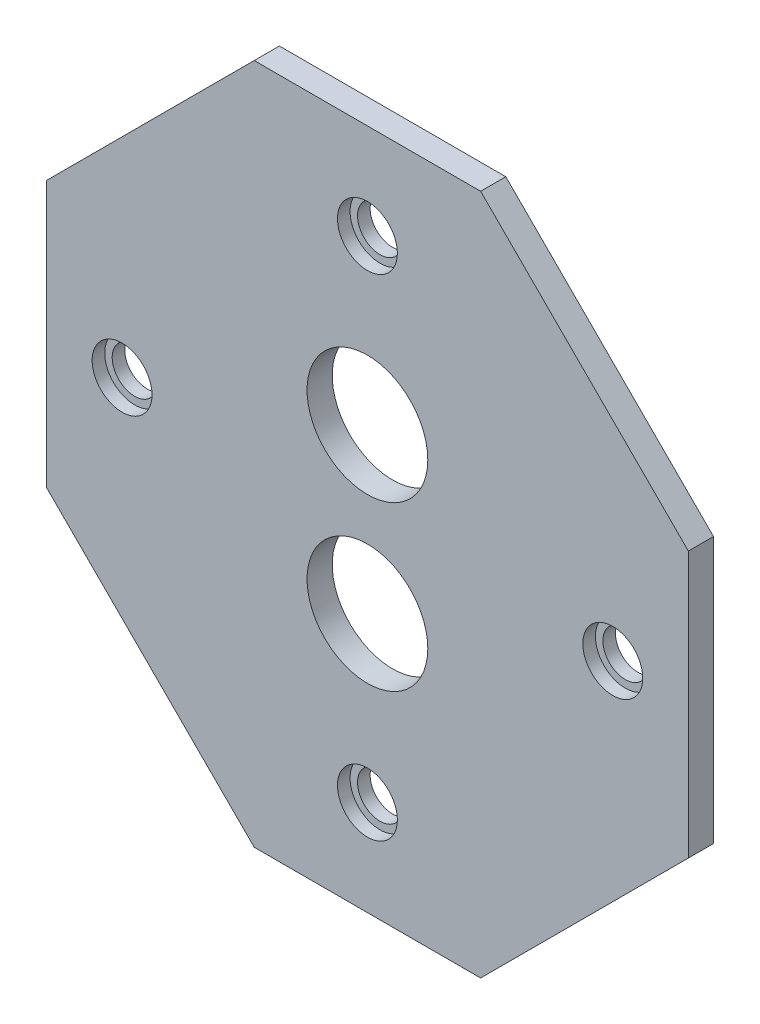
ISO-10303-21;
HEADER;
FILE_DESCRIPTION(('STEP AP214'),'2;1');
FILE_NAME('part.step','',(''),(''),'','','');
FILE_SCHEMA(('AUTOMOTIVE_DESIGN { 1 0 10303 214 1 1 1 1 }'));
ENDSEC;
DATA;
#1=APPLICATION_CONTEXT('core data for automotive mechanical design processes');
#2=APPLICATION_PROTOCOL_DEFINITION('international standard','automotive_design',2000,#1);
#3=PRODUCT_CONTEXT('',#1,'mechanical');
#4=PRODUCT('Part','Part','',(#3));
#5=PRODUCT_RELATED_PRODUCT_CATEGORY('part','',(#4));
#6=PRODUCT_DEFINITION_FORMATION('','',#4);
#7=PRODUCT_DEFINITION_CONTEXT('part definition',#1,'design');
#8=PRODUCT_DEFINITION('design','',#6,#7);
#9=PRODUCT_DEFINITION_SHAPE('','',#8);
#10=(LENGTH_UNIT() NAMED_UNIT(*) SI_UNIT(.MILLI.,.METRE.));
#11=(NAMED_UNIT(*) PLANE_ANGLE_UNIT() SI_UNIT($,.RADIAN.));
#12=(NAMED_UNIT(*) SI_UNIT($,.STERADIAN.) SOLID_ANGLE_UNIT());
#13=UNCERTAINTY_MEASURE_WITH_UNIT(LENGTH_MEASURE(1.E-05),#10,'distance_accuracy_value','');
#14=(GEOMETRIC_REPRESENTATION_CONTEXT(3) GLOBAL_UNCERTAINTY_ASSIGNED_CONTEXT((#13)) GLOBAL_UNIT_ASSIGNED_CONTEXT((#10,
#11,#12)) REPRESENTATION_CONTEXT('',''));
#15=CARTESIAN_POINT('',(0.,0.,0.));
#16=DIRECTION('',(0.,0.,1.));
#17=DIRECTION('',(1.,0.,0.));
#18=AXIS2_PLACEMENT_3D('',#15,#16,#17);
#19=CARTESIAN_POINT('',(0.,0.,5.334));
#20=DIRECTION('',(0.,0.,-1.));
#21=DIRECTION('',(-1.,0.,0.));
#22=AXIS2_PLACEMENT_3D('',#19,#20,#21);
#23=CYLINDRICAL_SURFACE('',#22,4.76250000000001);
#24=CARTESIAN_POINT('',(0.,0.,0.));
#25=DIRECTION('',(0.,0.,1.));
#26=DIRECTION('',(1.,0.,0.));
#27=AXIS2_PLACEMENT_3D('',#24,#25,#26);
#28=CIRCLE('',#27,4.76250000000001);
#29=CARTESIAN_POINT('',(4.76250000000001,0.,0.));
#30=VERTEX_POINT('',#29);
#31=EDGE_CURVE('E166',#30,#30,#28,.T.);
#32=ORIENTED_EDGE('',*,*,#31,.F.);
#33=EDGE_LOOP('',(#32));
#34=FACE_BOUND('',#33,.T.);
#35=CARTESIAN_POINT('',(0.,0.,2.667));
#36=DIRECTION('',(0.,0.,1.));
#37=DIRECTION('',(1.,0.,0.));
#38=AXIS2_PLACEMENT_3D('',#35,#36,#37);
#39=CIRCLE('',#38,4.7625);
#40=CARTESIAN_POINT('',(4.7625,0.,2.667));
#41=VERTEX_POINT('',#40);
#42=EDGE_CURVE('E201',#41,#41,#39,.T.);
#43=ORIENTED_EDGE('',*,*,#42,.T.);
#44=EDGE_LOOP('',(#43));
#45=FACE_BOUND('',#44,.T.);
#46=ADVANCED_FACE('F40',(#34,#45),#23,.F.);
#47=CARTESIAN_POINT('',(0.,124.233676973023,5.334));
#48=DIRECTION('',(0.,1.,0.));
#49=DIRECTION('',(0.,0.,1.));
#50=AXIS2_PLACEMENT_3D('',#47,#48,#49);
#51=PLANE('',#50);
#52=DIRECTION('',(1.,0.,0.));
#53=VECTOR('',#52,1.);
#54=CARTESIAN_POINT('',(0.,124.233676973023,0.));
#55=LINE('',#54,#53);
#56=CARTESIAN_POINT('',(-24.,124.233676973023,0.));
#57=VERTEX_POINT('',#56);
#58=CARTESIAN_POINT('',(24.,124.233676973023,0.));
#59=VERTEX_POINT('',#58);
#60=EDGE_CURVE('E157',#57,#59,#55,.T.);
#61=ORIENTED_EDGE('',*,*,#60,.F.);
#62=DIRECTION('',(0.,0.,-1.));
#63=VECTOR('',#62,1.);
#64=CARTESIAN_POINT('',(-24.,124.233676973023,5.334));
#65=LINE('',#64,#63);
#66=CARTESIAN_POINT('',(-24.,124.233676973023,5.334));
#67=VERTEX_POINT('',#66);
#68=EDGE_CURVE('E11',#67,#57,#65,.T.);
#69=ORIENTED_EDGE('',*,*,#68,.F.);
#70=DIRECTION('',(1.,0.,0.));
#71=VECTOR('',#70,1.);
#72=CARTESIAN_POINT('',(0.,124.233676973023,5.334));
#73=LINE('',#72,#71);
#74=CARTESIAN_POINT('',(24.,124.233676973023,5.334));
#75=VERTEX_POINT('',#74);
#76=EDGE_CURVE('E238',#67,#75,#73,.T.);
#77=ORIENTED_EDGE('',*,*,#76,.T.);
#78=DIRECTION('',(0.,0.,-1.));
#79=VECTOR('',#78,1.);
#80=CARTESIAN_POINT('',(24.,124.233676973023,5.334));
#81=LINE('',#80,#79);
#82=EDGE_CURVE('E57',#75,#59,#81,.T.);
#83=ORIENTED_EDGE('',*,*,#82,.T.);
#84=EDGE_LOOP('',(#61,#69,#77,#83));
#85=FACE_BOUND('',#84,.T.);
#86=ADVANCED_FACE('F197',(#85),#51,.T.);
#87=CARTESIAN_POINT('',(-74.1168384865117,74.1168384865114,5.334));
#88=DIRECTION('',(0.707106781186549,-0.707106781186546,0.));
#89=DIRECTION('',(0.707106781186546,0.707106781186549,0.));
#90=AXIS2_PLACEMENT_3D('',#87,#88,#89);
#91=PLANE('',#90);
#92=DIRECTION('',(-0.707106781186546,-0.707106781186549,0.));
#93=VECTOR('',#92,1.);
#94=CARTESIAN_POINT('',(-74.1168384865117,74.1168384865114,0.));
#95=LINE('',#94,#93);
#96=CARTESIAN_POINT('',(-68.0386467313756,80.1950302416475,0.));
#97=VERTEX_POINT('',#96);
#98=EDGE_CURVE('E153',#57,#97,#95,.T.);
#99=ORIENTED_EDGE('',*,*,#98,.T.);
#100=DIRECTION('',(0.,0.,-1.));
#101=VECTOR('',#100,1.);
#102=CARTESIAN_POINT('',(-68.0386467313756,80.1950302416475,5.334));
#103=LINE('',#102,#101);
#104=CARTESIAN_POINT('',(-68.0386467313756,80.1950302416475,5.334));
#105=VERTEX_POINT('',#104);
#106=EDGE_CURVE('E49',#105,#97,#103,.T.);
#107=ORIENTED_EDGE('',*,*,#106,.F.);
#108=DIRECTION('',(-0.707106781186546,-0.707106781186549,0.));
#109=VECTOR('',#108,1.);
#110=CARTESIAN_POINT('',(-74.1168384865117,74.1168384865114,5.334));
#111=LINE('',#110,#109);
#112=EDGE_CURVE('E240',#67,#105,#111,.T.);
#113=ORIENTED_EDGE('',*,*,#112,.F.);
#114=ORIENTED_EDGE('',*,*,#68,.T.);
#115=EDGE_LOOP('',(#99,#107,#113,#114));
#116=FACE_BOUND('',#115,.T.);
#117=ADVANCED_FACE('F154',(#116),#91,.F.);
#118=CARTESIAN_POINT('',(-68.0386467313756,0.,5.334));
#119=DIRECTION('',(1.,0.,0.));
#120=DIRECTION('',(0.,0.,-1.));
#121=AXIS2_PLACEMENT_3D('',#118,#119,#120);
#122=PLANE('',#121);
#123=DIRECTION('',(0.,-1.,0.));
#124=VECTOR('',#123,1.);
#125=CARTESIAN_POINT('',(-68.0386467313756,0.,0.));
#126=LINE('',#125,#124);
#127=CARTESIAN_POINT('',(-68.0386467313756,23.8299697583525,0.));
#128=VERTEX_POINT('',#127);
#129=EDGE_CURVE('E147',#97,#128,#126,.T.);
#130=ORIENTED_EDGE('',*,*,#129,.T.);
#131=DIRECTION('',(0.,0.,-1.));
#132=VECTOR('',#131,1.);
#133=CARTESIAN_POINT('',(-68.0386467313756,23.8299697583525,5.334));
#134=LINE('',#133,#132);
#135=CARTESIAN_POINT('',(-68.0386467313756,23.8299697583525,5.334));
#136=VERTEX_POINT('',#135);
#137=EDGE_CURVE('E139',#136,#128,#134,.T.);
#138=ORIENTED_EDGE('',*,*,#137,.F.);
#139=DIRECTION('',(0.,-1.,0.));
#140=VECTOR('',#139,1.);
#141=CARTESIAN_POINT('',(-68.0386467313756,0.,5.334));
#142=LINE('',#141,#140);
#143=EDGE_CURVE('E149',#105,#136,#142,.T.);
#144=ORIENTED_EDGE('',*,*,#143,.F.);
#145=ORIENTED_EDGE('',*,*,#106,.T.);
#146=EDGE_LOOP('',(#130,#138,#144,#145));
#147=FACE_BOUND('',#146,.T.);
#148=ADVANCED_FACE('F145',(#147),#122,.F.);
#149=CARTESIAN_POINT('',(-22.1043384865117,-22.1043384865116,5.334));
#150=DIRECTION('',(-0.707106781186549,-0.707106781186546,0.));
#151=DIRECTION('',(0.707106781186546,-0.707106781186549,0.));
#152=AXIS2_PLACEMENT_3D('',#149,#150,#151);
#153=PLANE('',#152);
#154=DIRECTION('',(-0.707106781186546,0.707106781186549,0.));
#155=VECTOR('',#154,1.);
#156=CARTESIAN_POINT('',(-22.1043384865117,-22.1043384865116,0.));
#157=LINE('',#156,#155);
#158=CARTESIAN_POINT('',(-24.,-20.2086769730233,0.));
#159=VERTEX_POINT('',#158);
#160=EDGE_CURVE('E163',#159,#128,#157,.T.);
#161=ORIENTED_EDGE('',*,*,#160,.F.);
#162=DIRECTION('',(0.,0.,-1.));
#163=VECTOR('',#162,1.);
#164=CARTESIAN_POINT('',(-24.,-20.2086769730233,5.334));
#165=LINE('',#164,#163);
#166=CARTESIAN_POINT('',(-24.,-20.2086769730233,5.334));
#167=VERTEX_POINT('',#166);
#168=EDGE_CURVE('E133',#167,#159,#165,.T.);
#169=ORIENTED_EDGE('',*,*,#168,.F.);
#170=DIRECTION('',(-0.707106781186546,0.707106781186549,0.));
#171=VECTOR('',#170,1.);
#172=CARTESIAN_POINT('',(-22.1043384865117,-22.1043384865116,5.334));
#173=LINE('',#172,#171);
#174=EDGE_CURVE('E243',#167,#136,#173,.T.);
#175=ORIENTED_EDGE('',*,*,#174,.T.);
#176=ORIENTED_EDGE('',*,*,#137,.T.);
#177=EDGE_LOOP('',(#161,#169,#175,#176));
#178=FACE_BOUND('',#177,.T.);
#179=ADVANCED_FACE('F248',(#178),#153,.T.);
#180=CARTESIAN_POINT('',(0.,-20.2086769730233,5.334));
#181=DIRECTION('',(0.,1.,0.));
#182=DIRECTION('',(0.,0.,1.));
#183=AXIS2_PLACEMENT_3D('',#180,#181,#182);
#184=PLANE('',#183);
#185=DIRECTION('',(1.,0.,0.));
#186=VECTOR('',#185,1.);
#187=CARTESIAN_POINT('',(0.,-20.2086769730233,0.));
#188=LINE('',#187,#186);
#189=CARTESIAN_POINT('',(24.,-20.2086769730233,0.));
#190=VERTEX_POINT('',#189);
#191=EDGE_CURVE('E171',#159,#190,#188,.T.);
#192=ORIENTED_EDGE('',*,*,#191,.T.);
#193=DIRECTION('',(0.,0.,-1.));
#194=VECTOR('',#193,1.);
#195=CARTESIAN_POINT('',(24.,-20.2086769730233,5.334));
#196=LINE('',#195,#194);
#197=CARTESIAN_POINT('',(24.,-20.2086769730233,5.334));
#198=VERTEX_POINT('',#197);
#199=EDGE_CURVE('E131',#198,#190,#196,.T.);
#200=ORIENTED_EDGE('',*,*,#199,.F.);
#201=DIRECTION('',(1.,0.,0.));
#202=VECTOR('',#201,1.);
#203=CARTESIAN_POINT('',(0.,-20.2086769730233,5.334));
#204=LINE('',#203,#202);
#205=EDGE_CURVE('E123',#167,#198,#204,.T.);
#206=ORIENTED_EDGE('',*,*,#205,.F.);
#207=ORIENTED_EDGE('',*,*,#168,.T.);
#208=EDGE_LOOP('',(#192,#200,#206,#207));
#209=FACE_BOUND('',#208,.T.);
#210=ADVANCED_FACE('F290',(#209),#184,.F.);
#211=CARTESIAN_POINT('',(22.1043384865117,-22.1043384865116,5.334));
#212=DIRECTION('',(-0.707106781186549,0.707106781186546,0.));
#213=DIRECTION('',(-0.707106781186546,-0.707106781186549,0.));
#214=AXIS2_PLACEMENT_3D('',#211,#212,#213);
#215=PLANE('',#214);
#216=DIRECTION('',(0.707106781186546,0.707106781186549,0.));
#217=VECTOR('',#216,1.);
#218=CARTESIAN_POINT('',(22.1043384865117,-22.1043384865116,0.));
#219=LINE('',#218,#217);
#220=CARTESIAN_POINT('',(68.0386467313756,23.8299697583525,0.));
#221=VERTEX_POINT('',#220);
#222=EDGE_CURVE('E130',#190,#221,#219,.T.);
#223=ORIENTED_EDGE('',*,*,#222,.T.);
#224=DIRECTION('',(0.,0.,-1.));
#225=VECTOR('',#224,1.);
#226=CARTESIAN_POINT('',(68.0386467313756,23.8299697583525,5.334));
#227=LINE('',#226,#225);
#228=CARTESIAN_POINT('',(68.0386467313756,23.8299697583525,5.334));
#229=VERTEX_POINT('',#228);
#230=EDGE_CURVE('E111',#229,#221,#227,.T.);
#231=ORIENTED_EDGE('',*,*,#230,.F.);
#232=DIRECTION('',(0.707106781186546,0.707106781186549,0.));
#233=VECTOR('',#232,1.);
#234=CARTESIAN_POINT('',(22.1043384865117,-22.1043384865116,5.334));
#235=LINE('',#234,#233);
#236=EDGE_CURVE('E116',#198,#229,#235,.T.);
#237=ORIENTED_EDGE('',*,*,#236,.F.);
#238=ORIENTED_EDGE('',*,*,#199,.T.);
#239=EDGE_LOOP('',(#223,#231,#237,#238));
#240=FACE_BOUND('',#239,.T.);
#241=ADVANCED_FACE('F129',(#240),#215,.F.);
#242=CARTESIAN_POINT('',(68.0386467313756,0.,5.334));
#243=DIRECTION('',(-1.,0.,0.));
#244=DIRECTION('',(0.,0.,1.));
#245=AXIS2_PLACEMENT_3D('',#242,#243,#244);
#246=PLANE('',#245);
#247=DIRECTION('',(0.,1.,0.));
#248=VECTOR('',#247,1.);
#249=CARTESIAN_POINT('',(68.0386467313756,0.,0.));
#250=LINE('',#249,#248);
#251=CARTESIAN_POINT('',(68.0386467313756,80.1950302416475,0.));
#252=VERTEX_POINT('',#251);
#253=EDGE_CURVE('E175',#221,#252,#250,.T.);
#254=ORIENTED_EDGE('',*,*,#253,.T.);
#255=DIRECTION('',(0.,0.,-1.));
#256=VECTOR('',#255,1.);
#257=CARTESIAN_POINT('',(68.0386467313756,80.1950302416475,5.334));
#258=LINE('',#257,#256);
#259=CARTESIAN_POINT('',(68.0386467313756,80.1950302416475,5.334));
#260=VERTEX_POINT('',#259);
#261=EDGE_CURVE('E83',#260,#252,#258,.T.);
#262=ORIENTED_EDGE('',*,*,#261,.F.);
#263=DIRECTION('',(0.,1.,0.));
#264=VECTOR('',#263,1.);
#265=CARTESIAN_POINT('',(68.0386467313756,0.,5.334));
#266=LINE('',#265,#264);
#267=EDGE_CURVE('E107',#229,#260,#266,.T.);
#268=ORIENTED_EDGE('',*,*,#267,.F.);
#269=ORIENTED_EDGE('',*,*,#230,.T.);
#270=EDGE_LOOP('',(#254,#262,#268,#269));
#271=FACE_BOUND('',#270,.T.);
#272=ADVANCED_FACE('F109',(#271),#246,.F.);
#273=CARTESIAN_POINT('',(0.,69.35,5.334));
#274=DIRECTION('',(0.,0.,-1.));
#275=DIRECTION('',(-1.,0.,0.));
#276=AXIS2_PLACEMENT_3D('',#273,#274,#275);
#277=CYLINDRICAL_SURFACE('',#276,12.8);
#278=CARTESIAN_POINT('',(0.,69.35,5.334));
#279=DIRECTION('',(0.,0.,1.));
#280=DIRECTION('',(1.,0.,0.));
#281=AXIS2_PLACEMENT_3D('',#278,#279,#280);
#282=CIRCLE('',#281,12.8);
#283=CARTESIAN_POINT('',(12.8,69.35,5.334));
#284=VERTEX_POINT('',#283);
#285=EDGE_CURVE('E235',#284,#284,#282,.T.);
#286=ORIENTED_EDGE('',*,*,#285,.T.);
#287=EDGE_LOOP('',(#286));
#288=FACE_BOUND('',#287,.T.);
#289=CARTESIAN_POINT('',(0.,69.35,0.));
#290=DIRECTION('',(0.,0.,1.));
#291=DIRECTION('',(1.,0.,0.));
#292=AXIS2_PLACEMENT_3D('',#289,#290,#291);
#293=CIRCLE('',#292,12.8);
#294=CARTESIAN_POINT('',(12.8,69.35,0.));
#295=VERTEX_POINT('',#294);
#296=EDGE_CURVE('E186',#295,#295,#293,.T.);
#297=ORIENTED_EDGE('',*,*,#296,.F.);
#298=EDGE_LOOP('',(#297));
#299=FACE_BOUND('',#298,.T.);
#300=ADVANCED_FACE('F256',(#288,#299),#277,.F.);
#301=CARTESIAN_POINT('',(0.,34.675,5.334));
#302=DIRECTION('',(0.,0.,-1.));
#303=DIRECTION('',(-1.,0.,0.));
#304=AXIS2_PLACEMENT_3D('',#301,#302,#303);
#305=CYLINDRICAL_SURFACE('',#304,12.8);
#306=CARTESIAN_POINT('',(0.,34.675,5.334));
#307=DIRECTION('',(0.,0.,1.));
#308=DIRECTION('',(1.,0.,0.));
#309=AXIS2_PLACEMENT_3D('',#306,#307,#308);
#310=CIRCLE('',#309,12.8);
#311=CARTESIAN_POINT('',(12.8,34.675,5.334));
#312=VERTEX_POINT('',#311);
#313=EDGE_CURVE('E179',#312,#312,#310,.T.);
#314=ORIENTED_EDGE('',*,*,#313,.T.);
#315=EDGE_LOOP('',(#314));
#316=FACE_BOUND('',#315,.T.);
#317=CARTESIAN_POINT('',(0.,34.675,0.));
#318=DIRECTION('',(0.,0.,1.));
#319=DIRECTION('',(1.,0.,0.));
#320=AXIS2_PLACEMENT_3D('',#317,#318,#319);
#321=CIRCLE('',#320,12.8);
#322=CARTESIAN_POINT('',(12.8,34.675,0.));
#323=VERTEX_POINT('',#322);
#324=EDGE_CURVE('E182',#323,#323,#321,.T.);
#325=ORIENTED_EDGE('',*,*,#324,.F.);
#326=EDGE_LOOP('',(#325));
#327=FACE_BOUND('',#326,.T.);
#328=ADVANCED_FACE('F42',(#316,#327),#305,.F.);
#329=CARTESIAN_POINT('',(74.1168384865117,74.1168384865114,5.334));
#330=DIRECTION('',(0.707106781186549,0.707106781186546,0.));
#331=DIRECTION('',(-0.707106781186546,0.707106781186549,0.));
#332=AXIS2_PLACEMENT_3D('',#329,#330,#331);
#333=PLANE('',#332);
#334=DIRECTION('',(0.707106781186546,-0.707106781186549,0.));
#335=VECTOR('',#334,1.);
#336=CARTESIAN_POINT('',(74.1168384865117,74.1168384865114,0.));
#337=LINE('',#336,#335);
#338=EDGE_CURVE('E177',#59,#252,#337,.T.);
#339=ORIENTED_EDGE('',*,*,#338,.F.);
#340=ORIENTED_EDGE('',*,*,#82,.F.);
#341=DIRECTION('',(0.707106781186546,-0.707106781186549,0.));
#342=VECTOR('',#341,1.);
#343=CARTESIAN_POINT('',(74.1168384865117,74.1168384865114,5.334));
#344=LINE('',#343,#342);
#345=EDGE_CURVE('E115',#75,#260,#344,.T.);
#346=ORIENTED_EDGE('',*,*,#345,.T.);
#347=ORIENTED_EDGE('',*,*,#261,.T.);
#348=EDGE_LOOP('',(#339,#340,#346,#347));
#349=FACE_BOUND('',#348,.T.);
#350=ADVANCED_FACE('F263',(#349),#333,.T.);
#351=CARTESIAN_POINT('',(0.,0.,5.334));
#352=DIRECTION('',(0.,0.,1.));
#353=DIRECTION('',(1.,0.,0.));
#354=AXIS2_PLACEMENT_3D('',#351,#352,#353);
#355=PLANE('',#354);
#356=CARTESIAN_POINT('',(0.,0.,5.334));
#357=DIRECTION('',(0.,0.,1.));
#358=DIRECTION('',(1.,0.,0.));
#359=AXIS2_PLACEMENT_3D('',#356,#357,#358);
#360=CIRCLE('',#359,6.35);
#361=CARTESIAN_POINT('',(6.35,0.,5.334));
#362=VERTEX_POINT('',#361);
#363=EDGE_CURVE('E203',#362,#362,#360,.T.);
#364=ORIENTED_EDGE('',*,*,#363,.F.);
#365=EDGE_LOOP('',(#364));
#366=FACE_BOUND('',#365,.T.);
#367=CARTESIAN_POINT('',(52.0125,52.0125,5.334));
#368=DIRECTION('',(0.,0.,1.));
#369=DIRECTION('',(1.,0.,0.));
#370=AXIS2_PLACEMENT_3D('',#367,#368,#369);
#371=CIRCLE('',#370,6.35);
#372=CARTESIAN_POINT('',(58.3625,52.0125,5.334));
#373=VERTEX_POINT('',#372);
#374=EDGE_CURVE('E210',#373,#373,#371,.T.);
#375=ORIENTED_EDGE('',*,*,#374,.F.);
#376=EDGE_LOOP('',(#375));
#377=FACE_BOUND('',#376,.T.);
#378=CARTESIAN_POINT('',(0.,104.025,5.334));
#379=DIRECTION('',(0.,0.,1.));
#380=DIRECTION('',(1.,0.,0.));
#381=AXIS2_PLACEMENT_3D('',#378,#379,#380);
#382=CIRCLE('',#381,6.34999999999999);
#383=CARTESIAN_POINT('',(6.34999999999999,104.025,5.334));
#384=VERTEX_POINT('',#383);
#385=EDGE_CURVE('E223',#384,#384,#382,.T.);
#386=ORIENTED_EDGE('',*,*,#385,.F.);
#387=EDGE_LOOP('',(#386));
#388=FACE_BOUND('',#387,.T.);
#389=CARTESIAN_POINT('',(-52.0125,52.0125,5.334));
#390=DIRECTION('',(0.,0.,1.));
#391=DIRECTION('',(1.,0.,0.));
#392=AXIS2_PLACEMENT_3D('',#389,#390,#391);
#393=CIRCLE('',#392,6.35);
#394=CARTESIAN_POINT('',(-45.6625,52.0125,5.334));
#395=VERTEX_POINT('',#394);
#396=EDGE_CURVE('E229',#395,#395,#393,.T.);
#397=ORIENTED_EDGE('',*,*,#396,.F.);
#398=EDGE_LOOP('',(#397));
#399=FACE_BOUND('',#398,.T.);
#400=ORIENTED_EDGE('',*,*,#313,.F.);
#401=EDGE_LOOP('',(#400));
#402=FACE_BOUND('',#401,.T.);
#403=ORIENTED_EDGE('',*,*,#285,.F.);
#404=EDGE_LOOP('',(#403));
#405=FACE_BOUND('',#404,.T.);
#406=ORIENTED_EDGE('',*,*,#76,.F.);
#407=ORIENTED_EDGE('',*,*,#112,.T.);
#408=ORIENTED_EDGE('',*,*,#143,.T.);
#409=ORIENTED_EDGE('',*,*,#174,.F.);
#410=ORIENTED_EDGE('',*,*,#205,.T.);
#411=ORIENTED_EDGE('',*,*,#236,.T.);
#412=ORIENTED_EDGE('',*,*,#267,.T.);
#413=ORIENTED_EDGE('',*,*,#345,.F.);
#414=EDGE_LOOP('',(#406,#407,#408,#409,#410,#411,#412,#413));
#415=FACE_BOUND('',#414,.T.);
#416=ADVANCED_FACE('F120',(#366,#377,#388,#399,#402,#405,#415),#355,.T.);
#417=CARTESIAN_POINT('',(0.,0.,0.));
#418=DIRECTION('',(0.,0.,1.));
#419=DIRECTION('',(1.,0.,0.));
#420=AXIS2_PLACEMENT_3D('',#417,#418,#419);
#421=PLANE('',#420);
#422=CARTESIAN_POINT('',(-52.0125,52.0125,0.));
#423=DIRECTION('',(0.,0.,1.));
#424=DIRECTION('',(1.,0.,0.));
#425=AXIS2_PLACEMENT_3D('',#422,#423,#424);
#426=CIRCLE('',#425,4.7625);
#427=CARTESIAN_POINT('',(-47.25,52.0125,0.));
#428=VERTEX_POINT('',#427);
#429=EDGE_CURVE('E470',#428,#428,#426,.T.);
#430=ORIENTED_EDGE('',*,*,#429,.T.);
#431=EDGE_LOOP('',(#430));
#432=FACE_BOUND('',#431,.T.);
#433=CARTESIAN_POINT('',(0.,104.025,0.));
#434=DIRECTION('',(0.,0.,1.));
#435=DIRECTION('',(1.,0.,0.));
#436=AXIS2_PLACEMENT_3D('',#433,#434,#435);
#437=CIRCLE('',#436,4.76249999999999);
#438=CARTESIAN_POINT('',(4.76249999999999,104.025,0.));
#439=VERTEX_POINT('',#438);
#440=EDGE_CURVE('E472',#439,#439,#437,.T.);
#441=ORIENTED_EDGE('',*,*,#440,.T.);
#442=EDGE_LOOP('',(#441));
#443=FACE_BOUND('',#442,.T.);
#444=CARTESIAN_POINT('',(52.0125,52.0125,0.));
#445=DIRECTION('',(0.,0.,1.));
#446=DIRECTION('',(1.,0.,0.));
#447=AXIS2_PLACEMENT_3D('',#444,#445,#446);
#448=CIRCLE('',#447,4.7625);
#449=CARTESIAN_POINT('',(56.775,52.0125,0.));
#450=VERTEX_POINT('',#449);
#451=EDGE_CURVE('E479',#450,#450,#448,.T.);
#452=ORIENTED_EDGE('',*,*,#451,.T.);
#453=EDGE_LOOP('',(#452));
#454=FACE_BOUND('',#453,.T.);
#455=ORIENTED_EDGE('',*,*,#324,.T.);
#456=EDGE_LOOP('',(#455));
#457=FACE_BOUND('',#456,.T.);
#458=ORIENTED_EDGE('',*,*,#296,.T.);
#459=EDGE_LOOP('',(#458));
#460=FACE_BOUND('',#459,.T.);
#461=ORIENTED_EDGE('',*,*,#31,.T.);
#462=EDGE_LOOP('',(#461));
#463=FACE_BOUND('',#462,.T.);
#464=ORIENTED_EDGE('',*,*,#60,.T.);
#465=ORIENTED_EDGE('',*,*,#338,.T.);
#466=ORIENTED_EDGE('',*,*,#253,.F.);
#467=ORIENTED_EDGE('',*,*,#222,.F.);
#468=ORIENTED_EDGE('',*,*,#191,.F.);
#469=ORIENTED_EDGE('',*,*,#160,.T.);
#470=ORIENTED_EDGE('',*,*,#129,.F.);
#471=ORIENTED_EDGE('',*,*,#98,.F.);
#472=EDGE_LOOP('',(#464,#465,#466,#467,#468,#469,#470,#471));
#473=FACE_BOUND('',#472,.T.);
#474=ADVANCED_FACE('F193',(#432,#443,#454,#457,#460,#463,#473),#421,.F.);
#475=CARTESIAN_POINT('',(-52.0125,52.0125,2.667));
#476=DIRECTION('',(0.,0.,1.));
#477=DIRECTION('',(1.,0.,0.));
#478=AXIS2_PLACEMENT_3D('',#475,#476,#477);
#479=CYLINDRICAL_SURFACE('',#478,6.35);
#480=CARTESIAN_POINT('',(-52.0125,52.0125,2.667));
#481=DIRECTION('',(0.,0.,1.));
#482=DIRECTION('',(1.,0.,0.));
#483=AXIS2_PLACEMENT_3D('',#480,#481,#482);
#484=CIRCLE('',#483,6.35);
#485=CARTESIAN_POINT('',(-45.6625,52.0125,2.667));
#486=VERTEX_POINT('',#485);
#487=EDGE_CURVE('E226',#486,#486,#484,.T.);
#488=ORIENTED_EDGE('',*,*,#487,.F.);
#489=EDGE_LOOP('',(#488));
#490=FACE_BOUND('',#489,.T.);
#491=ORIENTED_EDGE('',*,*,#396,.T.);
#492=EDGE_LOOP('',(#491));
#493=FACE_BOUND('',#492,.T.);
#494=ADVANCED_FACE('F271',(#490,#493),#479,.F.);
#495=CARTESIAN_POINT('',(-52.0125,52.0125,2.667));
#496=DIRECTION('',(0.,0.,1.));
#497=DIRECTION('',(1.,0.,0.));
#498=AXIS2_PLACEMENT_3D('',#495,#496,#497);
#499=PLANE('',#498);
#500=CARTESIAN_POINT('',(-52.0125,52.0125,2.667));
#501=DIRECTION('',(0.,0.,1.));
#502=DIRECTION('',(1.,0.,0.));
#503=AXIS2_PLACEMENT_3D('',#500,#501,#502);
#504=CIRCLE('',#503,4.7625);
#505=CARTESIAN_POINT('',(-47.25,52.0125,2.667));
#506=VERTEX_POINT('',#505);
#507=EDGE_CURVE('E214',#506,#506,#504,.T.);
#508=ORIENTED_EDGE('',*,*,#507,.F.);
#509=EDGE_LOOP('',(#508));
#510=FACE_BOUND('',#509,.T.);
#511=ORIENTED_EDGE('',*,*,#487,.T.);
#512=EDGE_LOOP('',(#511));
#513=FACE_BOUND('',#512,.T.);
#514=ADVANCED_FACE('F278',(#510,#513),#499,.T.);
#515=CARTESIAN_POINT('',(0.,104.025,2.667));
#516=DIRECTION('',(0.,0.,1.));
#517=DIRECTION('',(1.,0.,0.));
#518=AXIS2_PLACEMENT_3D('',#515,#516,#517);
#519=CYLINDRICAL_SURFACE('',#518,6.34999999999999);
#520=CARTESIAN_POINT('',(0.,104.025,2.667));
#521=DIRECTION('',(0.,0.,1.));
#522=DIRECTION('',(1.,0.,0.));
#523=AXIS2_PLACEMENT_3D('',#520,#521,#522);
#524=CIRCLE('',#523,6.34999999999999);
#525=CARTESIAN_POINT('',(6.34999999999999,104.025,2.667));
#526=VERTEX_POINT('',#525);
#527=EDGE_CURVE('E220',#526,#526,#524,.T.);
#528=ORIENTED_EDGE('',*,*,#527,.F.);
#529=EDGE_LOOP('',(#528));
#530=FACE_BOUND('',#529,.T.);
#531=ORIENTED_EDGE('',*,*,#385,.T.);
#532=EDGE_LOOP('',(#531));
#533=FACE_BOUND('',#532,.T.);
#534=ADVANCED_FACE('F364',(#530,#533),#519,.F.);
#535=CARTESIAN_POINT('',(0.,104.025,2.667));
#536=DIRECTION('',(0.,0.,1.));
#537=DIRECTION('',(1.,0.,0.));
#538=AXIS2_PLACEMENT_3D('',#535,#536,#537);
#539=PLANE('',#538);
#540=CARTESIAN_POINT('',(0.,104.025,2.667));
#541=DIRECTION('',(0.,0.,1.));
#542=DIRECTION('',(1.,0.,0.));
#543=AXIS2_PLACEMENT_3D('',#540,#541,#542);
#544=CIRCLE('',#543,4.76249999999999);
#545=CARTESIAN_POINT('',(4.76249999999999,104.025,2.667));
#546=VERTEX_POINT('',#545);
#547=EDGE_CURVE('E476',#546,#546,#544,.T.);
#548=ORIENTED_EDGE('',*,*,#547,.F.);
#549=EDGE_LOOP('',(#548));
#550=FACE_BOUND('',#549,.T.);
#551=ORIENTED_EDGE('',*,*,#527,.T.);
#552=EDGE_LOOP('',(#551));
#553=FACE_BOUND('',#552,.T.);
#554=ADVANCED_FACE('F374',(#550,#553),#539,.T.);
#555=CARTESIAN_POINT('',(52.0125,52.0125,2.667));
#556=DIRECTION('',(0.,0.,1.));
#557=DIRECTION('',(1.,0.,0.));
#558=AXIS2_PLACEMENT_3D('',#555,#556,#557);
#559=CYLINDRICAL_SURFACE('',#558,6.35);
#560=CARTESIAN_POINT('',(52.0125,52.0125,2.667));
#561=DIRECTION('',(0.,0.,1.));
#562=DIRECTION('',(1.,0.,0.));
#563=AXIS2_PLACEMENT_3D('',#560,#561,#562);
#564=CIRCLE('',#563,6.35);
#565=CARTESIAN_POINT('',(58.3625,52.0125,2.667));
#566=VERTEX_POINT('',#565);
#567=EDGE_CURVE('E204',#566,#566,#564,.T.);
#568=ORIENTED_EDGE('',*,*,#567,.F.);
#569=EDGE_LOOP('',(#568));
#570=FACE_BOUND('',#569,.T.);
#571=ORIENTED_EDGE('',*,*,#374,.T.);
#572=EDGE_LOOP('',(#571));
#573=FACE_BOUND('',#572,.T.);
#574=ADVANCED_FACE('F384',(#570,#573),#559,.F.);
#575=CARTESIAN_POINT('',(52.0125,52.0125,2.667));
#576=DIRECTION('',(0.,0.,1.));
#577=DIRECTION('',(1.,0.,0.));
#578=AXIS2_PLACEMENT_3D('',#575,#576,#577);
#579=PLANE('',#578);
#580=CARTESIAN_POINT('',(52.0125,52.0125,2.667));
#581=DIRECTION('',(0.,0.,1.));
#582=DIRECTION('',(1.,0.,0.));
#583=AXIS2_PLACEMENT_3D('',#580,#581,#582);
#584=CIRCLE('',#583,4.7625);
#585=CARTESIAN_POINT('',(56.775,52.0125,2.667));
#586=VERTEX_POINT('',#585);
#587=EDGE_CURVE('E471',#586,#586,#584,.T.);
#588=ORIENTED_EDGE('',*,*,#587,.F.);
#589=EDGE_LOOP('',(#588));
#590=FACE_BOUND('',#589,.T.);
#591=ORIENTED_EDGE('',*,*,#567,.T.);
#592=EDGE_LOOP('',(#591));
#593=FACE_BOUND('',#592,.T.);
#594=ADVANCED_FACE('F395',(#590,#593),#579,.T.);
#595=CARTESIAN_POINT('',(0.,0.,2.667));
#596=DIRECTION('',(0.,0.,1.));
#597=DIRECTION('',(1.,0.,0.));
#598=AXIS2_PLACEMENT_3D('',#595,#596,#597);
#599=CYLINDRICAL_SURFACE('',#598,6.35);
#600=CARTESIAN_POINT('',(0.,0.,2.667));
#601=DIRECTION('',(0.,0.,1.));
#602=DIRECTION('',(1.,0.,0.));
#603=AXIS2_PLACEMENT_3D('',#600,#601,#602);
#604=CIRCLE('',#603,6.35);
#605=CARTESIAN_POINT('',(6.35,0.,2.667));
#606=VERTEX_POINT('',#605);
#607=EDGE_CURVE('E187',#606,#606,#604,.T.);
#608=ORIENTED_EDGE('',*,*,#607,.F.);
#609=EDGE_LOOP('',(#608));
#610=FACE_BOUND('',#609,.T.);
#611=ORIENTED_EDGE('',*,*,#363,.T.);
#612=EDGE_LOOP('',(#611));
#613=FACE_BOUND('',#612,.T.);
#614=ADVANCED_FACE('F406',(#610,#613),#599,.F.);
#615=CARTESIAN_POINT('',(0.,0.,2.667));
#616=DIRECTION('',(0.,0.,1.));
#617=DIRECTION('',(1.,0.,0.));
#618=AXIS2_PLACEMENT_3D('',#615,#616,#617);
#619=PLANE('',#618);
#620=ORIENTED_EDGE('',*,*,#42,.F.);
#621=EDGE_LOOP('',(#620));
#622=FACE_BOUND('',#621,.T.);
#623=ORIENTED_EDGE('',*,*,#607,.T.);
#624=EDGE_LOOP('',(#623));
#625=FACE_BOUND('',#624,.T.);
#626=ADVANCED_FACE('F416',(#622,#625),#619,.T.);
#627=CARTESIAN_POINT('',(52.0125,52.0125,0.));
#628=DIRECTION('',(0.,0.,1.));
#629=DIRECTION('',(1.,0.,0.));
#630=AXIS2_PLACEMENT_3D('',#627,#628,#629);
#631=CYLINDRICAL_SURFACE('',#630,4.7625);
#632=ORIENTED_EDGE('',*,*,#587,.T.);
#633=EDGE_LOOP('',(#632));
#634=FACE_BOUND('',#633,.T.);
#635=ORIENTED_EDGE('',*,*,#451,.F.);
#636=EDGE_LOOP('',(#635));
#637=FACE_BOUND('',#636,.T.);
#638=ADVANCED_FACE('F426',(#634,#637),#631,.F.);
#639=CARTESIAN_POINT('',(0.,104.025,0.));
#640=DIRECTION('',(0.,0.,1.));
#641=DIRECTION('',(1.,0.,0.));
#642=AXIS2_PLACEMENT_3D('',#639,#640,#641);
#643=CYLINDRICAL_SURFACE('',#642,4.76249999999999);
#644=ORIENTED_EDGE('',*,*,#547,.T.);
#645=EDGE_LOOP('',(#644));
#646=FACE_BOUND('',#645,.T.);
#647=ORIENTED_EDGE('',*,*,#440,.F.);
#648=EDGE_LOOP('',(#647));
#649=FACE_BOUND('',#648,.T.);
#650=ADVANCED_FACE('F440',(#646,#649),#643,.F.);
#651=CARTESIAN_POINT('',(-52.0125,52.0125,0.));
#652=DIRECTION('',(0.,0.,1.));
#653=DIRECTION('',(1.,0.,0.));
#654=AXIS2_PLACEMENT_3D('',#651,#652,#653);
#655=CYLINDRICAL_SURFACE('',#654,4.7625);
#656=ORIENTED_EDGE('',*,*,#507,.T.);
#657=EDGE_LOOP('',(#656));
#658=FACE_BOUND('',#657,.T.);
#659=ORIENTED_EDGE('',*,*,#429,.F.);
#660=EDGE_LOOP('',(#659));
#661=FACE_BOUND('',#660,.T.);
#662=ADVANCED_FACE('F450',(#658,#661),#655,.F.);
#663=CLOSED_SHELL('',(#46,#86,#117,#148,#179,#210,#241,#272,#300,#328,#350,#416,#474,#494,#514,
#534,#554,#574,#594,#614,#626,#638,#650,#662));
#664=MANIFOLD_SOLID_BREP('B2',#663);
#665=ADVANCED_BREP_SHAPE_REPRESENTATION('',(#18,#664),#14);
#666=SHAPE_DEFINITION_REPRESENTATION(#9,#665);
ENDSEC;
END-ISO-10303-21;
